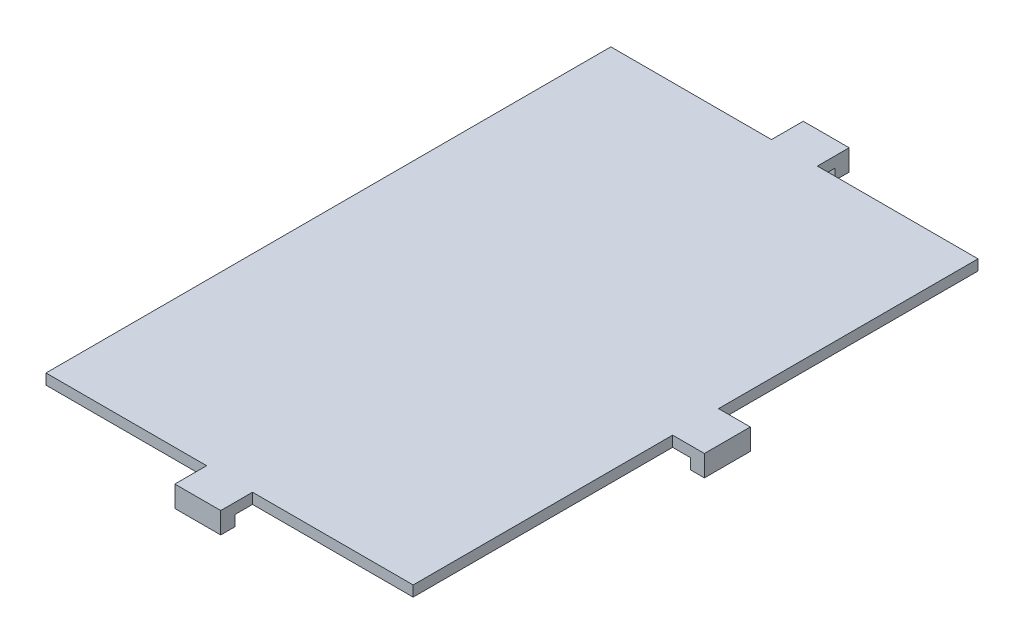
ISO-10303-21;
HEADER;
FILE_DESCRIPTION(('STEP AP214'),'2;1');
FILE_NAME('part.step','',(''),(''),'','','');
FILE_SCHEMA(('AUTOMOTIVE_DESIGN { 1 0 10303 214 1 1 1 1 }'));
ENDSEC;
DATA;
#1=APPLICATION_CONTEXT('core data for automotive mechanical design processes');
#2=APPLICATION_PROTOCOL_DEFINITION('international standard','automotive_design',2000,#1);
#3=PRODUCT_CONTEXT('',#1,'mechanical');
#4=PRODUCT('Part','Part','',(#3));
#5=PRODUCT_RELATED_PRODUCT_CATEGORY('part','',(#4));
#6=PRODUCT_DEFINITION_FORMATION('','',#4);
#7=PRODUCT_DEFINITION_CONTEXT('part definition',#1,'design');
#8=PRODUCT_DEFINITION('design','',#6,#7);
#9=PRODUCT_DEFINITION_SHAPE('','',#8);
#10=(LENGTH_UNIT() NAMED_UNIT(*) SI_UNIT(.MILLI.,.METRE.));
#11=(NAMED_UNIT(*) PLANE_ANGLE_UNIT() SI_UNIT($,.RADIAN.));
#12=(NAMED_UNIT(*) SI_UNIT($,.STERADIAN.) SOLID_ANGLE_UNIT());
#13=UNCERTAINTY_MEASURE_WITH_UNIT(LENGTH_MEASURE(1.E-05),#10,'distance_accuracy_value','');
#14=(GEOMETRIC_REPRESENTATION_CONTEXT(3) GLOBAL_UNCERTAINTY_ASSIGNED_CONTEXT((#13)) GLOBAL_UNIT_ASSIGNED_CONTEXT((#10,
#11,#12)) REPRESENTATION_CONTEXT('',''));
#15=CARTESIAN_POINT('',(0.,0.,0.));
#16=DIRECTION('',(0.,0.,1.));
#17=DIRECTION('',(1.,0.,0.));
#18=AXIS2_PLACEMENT_3D('',#15,#16,#17);
#19=CARTESIAN_POINT('',(0.,1.5,0.));
#20=DIRECTION('',(0.,-1.,0.));
#21=DIRECTION('',(0.,0.,-1.));
#22=AXIS2_PLACEMENT_3D('',#19,#20,#21);
#23=PLANE('',#22);
#24=DIRECTION('',(1.,0.,0.));
#25=VECTOR('',#24,1.);
#26=CARTESIAN_POINT('',(0.,1.5,-80.5));
#27=LINE('',#26,#25);
#28=CARTESIAN_POINT('',(0.5,1.5,-80.5));
#29=VERTEX_POINT('',#28);
#30=CARTESIAN_POINT('',(23.25,1.5,-80.5));
#31=VERTEX_POINT('',#30);
#32=EDGE_CURVE('E203',#29,#31,#27,.T.);
#33=ORIENTED_EDGE('',*,*,#32,.F.);
#34=DIRECTION('',(0.,0.,-1.));
#35=VECTOR('',#34,1.);
#36=CARTESIAN_POINT('',(0.5,1.5,-80.5));
#37=LINE('',#36,#35);
#38=CARTESIAN_POINT('',(0.500000000000011,1.5,-0.5));
#39=VERTEX_POINT('',#38);
#40=EDGE_CURVE('E189',#39,#29,#37,.T.);
#41=ORIENTED_EDGE('',*,*,#40,.F.);
#42=DIRECTION('',(-1.,0.,0.));
#43=VECTOR('',#42,1.);
#44=CARTESIAN_POINT('',(0.,1.5,-0.5));
#45=LINE('',#44,#43);
#46=CARTESIAN_POINT('',(23.25,1.5,-0.5));
#47=VERTEX_POINT('',#46);
#48=EDGE_CURVE('E200',#47,#39,#45,.T.);
#49=ORIENTED_EDGE('',*,*,#48,.F.);
#50=DIRECTION('',(0.,0.,-1.));
#51=VECTOR('',#50,1.);
#52=CARTESIAN_POINT('',(23.25,1.5,-0.5));
#53=LINE('',#52,#51);
#54=CARTESIAN_POINT('',(23.25,1.5,4.));
#55=VERTEX_POINT('',#54);
#56=EDGE_CURVE('E339',#55,#47,#53,.T.);
#57=ORIENTED_EDGE('',*,*,#56,.F.);
#58=DIRECTION('',(1.,0.,0.));
#59=VECTOR('',#58,1.);
#60=CARTESIAN_POINT('',(23.,1.5,4.));
#61=LINE('',#60,#59);
#62=CARTESIAN_POINT('',(29.75,1.5,4.));
#63=VERTEX_POINT('',#62);
#64=EDGE_CURVE('E226',#55,#63,#61,.T.);
#65=ORIENTED_EDGE('',*,*,#64,.T.);
#66=DIRECTION('',(0.,0.,1.));
#67=VECTOR('',#66,1.);
#68=CARTESIAN_POINT('',(29.75,1.5,4.));
#69=LINE('',#68,#67);
#70=CARTESIAN_POINT('',(29.75,1.5,-0.5));
#71=VERTEX_POINT('',#70);
#72=EDGE_CURVE('E322',#71,#63,#69,.T.);
#73=ORIENTED_EDGE('',*,*,#72,.F.);
#74=DIRECTION('',(-1.,0.,0.));
#75=VECTOR('',#74,1.);
#76=CARTESIAN_POINT('',(30.,1.5,-0.5));
#77=LINE('',#76,#75);
#78=CARTESIAN_POINT('',(52.5,1.5,-0.5));
#79=VERTEX_POINT('',#78);
#80=EDGE_CURVE('E214',#79,#71,#77,.T.);
#81=ORIENTED_EDGE('',*,*,#80,.F.);
#82=DIRECTION('',(0.,0.,1.));
#83=VECTOR('',#82,1.);
#84=CARTESIAN_POINT('',(52.5,1.5,-0.5));
#85=LINE('',#84,#83);
#86=CARTESIAN_POINT('',(52.5,1.5,-37.25));
#87=VERTEX_POINT('',#86);
#88=EDGE_CURVE('E321',#87,#79,#85,.T.);
#89=ORIENTED_EDGE('',*,*,#88,.F.);
#90=DIRECTION('',(-1.,0.,0.));
#91=VECTOR('',#90,1.);
#92=CARTESIAN_POINT('',(53.,1.5,-37.25));
#93=LINE('',#92,#91);
#94=CARTESIAN_POINT('',(57.,1.5,-37.25));
#95=VERTEX_POINT('',#94);
#96=EDGE_CURVE('E359',#95,#87,#93,.T.);
#97=ORIENTED_EDGE('',*,*,#96,.F.);
#98=DIRECTION('',(0.,0.,-1.));
#99=VECTOR('',#98,1.);
#100=CARTESIAN_POINT('',(57.,1.5,-44.));
#101=LINE('',#100,#99);
#102=CARTESIAN_POINT('',(57.,1.5,-43.75));
#103=VERTEX_POINT('',#102);
#104=EDGE_CURVE('E248',#95,#103,#101,.T.);
#105=ORIENTED_EDGE('',*,*,#104,.T.);
#106=DIRECTION('',(1.,0.,0.));
#107=VECTOR('',#106,1.);
#108=CARTESIAN_POINT('',(53.,1.5,-43.75));
#109=LINE('',#108,#107);
#110=CARTESIAN_POINT('',(52.5,1.5,-43.75));
#111=VERTEX_POINT('',#110);
#112=EDGE_CURVE('E353',#111,#103,#109,.T.);
#113=ORIENTED_EDGE('',*,*,#112,.F.);
#114=DIRECTION('',(0.,0.,1.));
#115=VECTOR('',#114,1.);
#116=CARTESIAN_POINT('',(52.5,1.5,-43.75));
#117=LINE('',#116,#115);
#118=CARTESIAN_POINT('',(52.5,1.5,-80.5));
#119=VERTEX_POINT('',#118);
#120=EDGE_CURVE('E428',#119,#111,#117,.T.);
#121=ORIENTED_EDGE('',*,*,#120,.F.);
#122=DIRECTION('',(1.,0.,0.));
#123=VECTOR('',#122,1.);
#124=CARTESIAN_POINT('',(30.,1.5,-80.5));
#125=LINE('',#124,#123);
#126=CARTESIAN_POINT('',(29.75,1.5,-80.5));
#127=VERTEX_POINT('',#126);
#128=EDGE_CURVE('E213',#127,#119,#125,.T.);
#129=ORIENTED_EDGE('',*,*,#128,.F.);
#130=DIRECTION('',(0.,0.,1.));
#131=VECTOR('',#130,1.);
#132=CARTESIAN_POINT('',(29.75,1.5,-80.5));
#133=LINE('',#132,#131);
#134=CARTESIAN_POINT('',(29.75,1.5,-85.));
#135=VERTEX_POINT('',#134);
#136=EDGE_CURVE('E341',#135,#127,#133,.T.);
#137=ORIENTED_EDGE('',*,*,#136,.F.);
#138=DIRECTION('',(-1.,0.,0.));
#139=VECTOR('',#138,1.);
#140=CARTESIAN_POINT('',(23.,1.5,-85.));
#141=LINE('',#140,#139);
#142=CARTESIAN_POINT('',(23.25,1.5,-85.));
#143=VERTEX_POINT('',#142);
#144=EDGE_CURVE('E236',#135,#143,#141,.T.);
#145=ORIENTED_EDGE('',*,*,#144,.T.);
#146=DIRECTION('',(0.,0.,-1.));
#147=VECTOR('',#146,1.);
#148=CARTESIAN_POINT('',(23.25,1.5,-80.5));
#149=LINE('',#148,#147);
#150=EDGE_CURVE('E350',#31,#143,#149,.T.);
#151=ORIENTED_EDGE('',*,*,#150,.F.);
#152=EDGE_LOOP('',(#33,#41,#49,#57,#65,#73,#81,#89,#97,#105,#113,#121,#129,#137,#145,#151));
#153=FACE_BOUND('',#152,.T.);
#154=ADVANCED_FACE('F39',(#153),#23,.F.);
#155=CARTESIAN_POINT('',(0.,0.,0.));
#156=DIRECTION('',(0.,-1.,0.));
#157=DIRECTION('',(0.,0.,-1.));
#158=AXIS2_PLACEMENT_3D('',#155,#156,#157);
#159=PLANE('',#158);
#160=DIRECTION('',(0.,0.,1.));
#161=VECTOR('',#160,1.);
#162=CARTESIAN_POINT('',(0.500000000000011,0.,0.));
#163=LINE('',#162,#161);
#164=CARTESIAN_POINT('',(0.5,0.,-80.5));
#165=VERTEX_POINT('',#164);
#166=CARTESIAN_POINT('',(0.500000000000011,0.,-0.5));
#167=VERTEX_POINT('',#166);
#168=EDGE_CURVE('E55',#165,#167,#163,.T.);
#169=ORIENTED_EDGE('',*,*,#168,.F.);
#170=DIRECTION('',(-1.,0.,0.));
#171=VECTOR('',#170,1.);
#172=CARTESIAN_POINT('',(0.,0.,-80.5));
#173=LINE('',#172,#171);
#174=CARTESIAN_POINT('',(23.25,0.,-80.5));
#175=VERTEX_POINT('',#174);
#176=EDGE_CURVE('E278',#175,#165,#173,.T.);
#177=ORIENTED_EDGE('',*,*,#176,.F.);
#178=DIRECTION('',(0.,0.,1.));
#179=VECTOR('',#178,1.);
#180=CARTESIAN_POINT('',(23.25,0.,0.));
#181=LINE('',#180,#179);
#182=CARTESIAN_POINT('',(23.25,0.,-83.));
#183=VERTEX_POINT('',#182);
#184=EDGE_CURVE('E397',#183,#175,#181,.T.);
#185=ORIENTED_EDGE('',*,*,#184,.F.);
#186=DIRECTION('',(-1.,0.,0.));
#187=VECTOR('',#186,1.);
#188=CARTESIAN_POINT('',(23.,0.,-83.));
#189=LINE('',#188,#187);
#190=CARTESIAN_POINT('',(29.75,0.,-83.));
#191=VERTEX_POINT('',#190);
#192=EDGE_CURVE('E271',#191,#183,#189,.T.);
#193=ORIENTED_EDGE('',*,*,#192,.F.);
#194=DIRECTION('',(0.,0.,-1.));
#195=VECTOR('',#194,1.);
#196=CARTESIAN_POINT('',(29.75,0.,0.));
#197=LINE('',#196,#195);
#198=CARTESIAN_POINT('',(29.75,0.,-80.5));
#199=VERTEX_POINT('',#198);
#200=EDGE_CURVE('E404',#199,#191,#197,.T.);
#201=ORIENTED_EDGE('',*,*,#200,.F.);
#202=DIRECTION('',(-1.,0.,0.));
#203=VECTOR('',#202,1.);
#204=CARTESIAN_POINT('',(0.,0.,-80.5));
#205=LINE('',#204,#203);
#206=CARTESIAN_POINT('',(52.5,0.,-80.5));
#207=VERTEX_POINT('',#206);
#208=EDGE_CURVE('E275',#207,#199,#205,.T.);
#209=ORIENTED_EDGE('',*,*,#208,.F.);
#210=DIRECTION('',(0.,0.,-1.));
#211=VECTOR('',#210,1.);
#212=CARTESIAN_POINT('',(52.5,0.,0.));
#213=LINE('',#212,#211);
#214=CARTESIAN_POINT('',(52.5,0.,-43.75));
#215=VERTEX_POINT('',#214);
#216=EDGE_CURVE('E328',#215,#207,#213,.T.);
#217=ORIENTED_EDGE('',*,*,#216,.F.);
#218=DIRECTION('',(-1.,0.,0.));
#219=VECTOR('',#218,1.);
#220=CARTESIAN_POINT('',(0.,0.,-43.75));
#221=LINE('',#220,#219);
#222=CARTESIAN_POINT('',(55.,0.,-43.75));
#223=VERTEX_POINT('',#222);
#224=EDGE_CURVE('E220',#223,#215,#221,.T.);
#225=ORIENTED_EDGE('',*,*,#224,.F.);
#226=DIRECTION('',(0.,0.,-1.));
#227=VECTOR('',#226,1.);
#228=CARTESIAN_POINT('',(55.,0.,-44.));
#229=LINE('',#228,#227);
#230=CARTESIAN_POINT('',(55.,0.,-37.25));
#231=VERTEX_POINT('',#230);
#232=EDGE_CURVE('E267',#231,#223,#229,.T.);
#233=ORIENTED_EDGE('',*,*,#232,.F.);
#234=DIRECTION('',(1.,0.,0.));
#235=VECTOR('',#234,1.);
#236=CARTESIAN_POINT('',(0.,0.,-37.25));
#237=LINE('',#236,#235);
#238=CARTESIAN_POINT('',(52.5,0.,-37.25));
#239=VERTEX_POINT('',#238);
#240=EDGE_CURVE('E410',#239,#231,#237,.T.);
#241=ORIENTED_EDGE('',*,*,#240,.F.);
#242=DIRECTION('',(0.,0.,-1.));
#243=VECTOR('',#242,1.);
#244=CARTESIAN_POINT('',(52.5,0.,0.));
#245=LINE('',#244,#243);
#246=CARTESIAN_POINT('',(52.5,0.,-0.5));
#247=VERTEX_POINT('',#246);
#248=EDGE_CURVE('E334',#247,#239,#245,.T.);
#249=ORIENTED_EDGE('',*,*,#248,.F.);
#250=DIRECTION('',(1.,0.,0.));
#251=VECTOR('',#250,1.);
#252=CARTESIAN_POINT('',(0.,0.,-0.5));
#253=LINE('',#252,#251);
#254=CARTESIAN_POINT('',(29.75,0.,-0.5));
#255=VERTEX_POINT('',#254);
#256=EDGE_CURVE('E282',#255,#247,#253,.T.);
#257=ORIENTED_EDGE('',*,*,#256,.F.);
#258=DIRECTION('',(0.,0.,-1.));
#259=VECTOR('',#258,1.);
#260=CARTESIAN_POINT('',(29.75,0.,0.));
#261=LINE('',#260,#259);
#262=CARTESIAN_POINT('',(29.75,0.,2.));
#263=VERTEX_POINT('',#262);
#264=EDGE_CURVE('E384',#263,#255,#261,.T.);
#265=ORIENTED_EDGE('',*,*,#264,.F.);
#266=DIRECTION('',(1.,0.,0.));
#267=VECTOR('',#266,1.);
#268=CARTESIAN_POINT('',(23.,0.,2.));
#269=LINE('',#268,#267);
#270=CARTESIAN_POINT('',(23.25,0.,2.));
#271=VERTEX_POINT('',#270);
#272=EDGE_CURVE('E260',#271,#263,#269,.T.);
#273=ORIENTED_EDGE('',*,*,#272,.F.);
#274=DIRECTION('',(0.,0.,1.));
#275=VECTOR('',#274,1.);
#276=CARTESIAN_POINT('',(23.25,0.,0.));
#277=LINE('',#276,#275);
#278=CARTESIAN_POINT('',(23.25,0.,-0.5));
#279=VERTEX_POINT('',#278);
#280=EDGE_CURVE('E391',#279,#271,#277,.T.);
#281=ORIENTED_EDGE('',*,*,#280,.F.);
#282=DIRECTION('',(1.,0.,0.));
#283=VECTOR('',#282,1.);
#284=CARTESIAN_POINT('',(0.,0.,-0.5));
#285=LINE('',#284,#283);
#286=EDGE_CURVE('E286',#167,#279,#285,.T.);
#287=ORIENTED_EDGE('',*,*,#286,.F.);
#288=EDGE_LOOP('',(#169,#177,#185,#193,#201,#209,#217,#225,#233,#241,#249,#257,#265,#273,#281,#287));
#289=FACE_BOUND('',#288,.T.);
#290=ADVANCED_FACE('F41',(#289),#159,.T.);
#291=CARTESIAN_POINT('',(55.,-1.5,-44.));
#292=DIRECTION('',(-1.,0.,0.));
#293=DIRECTION('',(0.,0.,1.));
#294=AXIS2_PLACEMENT_3D('',#291,#292,#293);
#295=PLANE('',#294);
#296=DIRECTION('',(0.,1.,0.));
#297=VECTOR('',#296,1.);
#298=CARTESIAN_POINT('',(55.,-1.5,-43.75));
#299=LINE('',#298,#297);
#300=CARTESIAN_POINT('',(55.,-1.5,-43.75));
#301=VERTEX_POINT('',#300);
#302=EDGE_CURVE('E412',#301,#223,#299,.T.);
#303=ORIENTED_EDGE('',*,*,#302,.F.);
#304=DIRECTION('',(0.,0.,1.));
#305=VECTOR('',#304,1.);
#306=CARTESIAN_POINT('',(55.,-1.5,-44.));
#307=LINE('',#306,#305);
#308=CARTESIAN_POINT('',(55.,-1.5,-37.25));
#309=VERTEX_POINT('',#308);
#310=EDGE_CURVE('E252',#301,#309,#307,.T.);
#311=ORIENTED_EDGE('',*,*,#310,.T.);
#312=DIRECTION('',(0.,-1.,0.));
#313=VECTOR('',#312,1.);
#314=CARTESIAN_POINT('',(55.,-1.5,-37.25));
#315=LINE('',#314,#313);
#316=EDGE_CURVE('E407',#231,#309,#315,.T.);
#317=ORIENTED_EDGE('',*,*,#316,.F.);
#318=ORIENTED_EDGE('',*,*,#232,.T.);
#319=EDGE_LOOP('',(#303,#311,#317,#318));
#320=FACE_BOUND('',#319,.T.);
#321=ADVANCED_FACE('F486',(#320),#295,.T.);
#322=CARTESIAN_POINT('',(57.,-1.5,-44.));
#323=DIRECTION('',(1.,0.,0.));
#324=DIRECTION('',(0.,0.,-1.));
#325=AXIS2_PLACEMENT_3D('',#322,#323,#324);
#326=PLANE('',#325);
#327=DIRECTION('',(0.,1.,0.));
#328=VECTOR('',#327,1.);
#329=CARTESIAN_POINT('',(57.,-8.5,-43.75));
#330=LINE('',#329,#328);
#331=CARTESIAN_POINT('',(57.,-1.5,-43.75));
#332=VERTEX_POINT('',#331);
#333=EDGE_CURVE('E63',#332,#103,#330,.T.);
#334=ORIENTED_EDGE('',*,*,#333,.T.);
#335=ORIENTED_EDGE('',*,*,#104,.F.);
#336=DIRECTION('',(0.,1.,0.));
#337=VECTOR('',#336,1.);
#338=CARTESIAN_POINT('',(57.,-8.5,-37.25));
#339=LINE('',#338,#337);
#340=CARTESIAN_POINT('',(57.,-1.5,-37.25));
#341=VERTEX_POINT('',#340);
#342=EDGE_CURVE('E356',#341,#95,#339,.T.);
#343=ORIENTED_EDGE('',*,*,#342,.F.);
#344=DIRECTION('',(0.,0.,-1.));
#345=VECTOR('',#344,1.);
#346=CARTESIAN_POINT('',(57.,-1.5,-44.));
#347=LINE('',#346,#345);
#348=EDGE_CURVE('E256',#341,#332,#347,.T.);
#349=ORIENTED_EDGE('',*,*,#348,.T.);
#350=EDGE_LOOP('',(#334,#335,#343,#349));
#351=FACE_BOUND('',#350,.T.);
#352=ADVANCED_FACE('F480',(#351),#326,.T.);
#353=CARTESIAN_POINT('',(0.,-1.5,0.));
#354=DIRECTION('',(0.,1.,0.));
#355=DIRECTION('',(0.,0.,1.));
#356=AXIS2_PLACEMENT_3D('',#353,#354,#355);
#357=PLANE('',#356);
#358=ORIENTED_EDGE('',*,*,#310,.F.);
#359=DIRECTION('',(1.,0.,0.));
#360=VECTOR('',#359,1.);
#361=CARTESIAN_POINT('',(0.,-1.5,-43.75));
#362=LINE('',#361,#360);
#363=EDGE_CURVE('E195',#301,#332,#362,.T.);
#364=ORIENTED_EDGE('',*,*,#363,.T.);
#365=ORIENTED_EDGE('',*,*,#348,.F.);
#366=DIRECTION('',(-1.,0.,0.));
#367=VECTOR('',#366,1.);
#368=CARTESIAN_POINT('',(0.,-1.5,-37.25));
#369=LINE('',#368,#367);
#370=EDGE_CURVE('E303',#341,#309,#369,.T.);
#371=ORIENTED_EDGE('',*,*,#370,.T.);
#372=EDGE_LOOP('',(#358,#364,#365,#371));
#373=FACE_BOUND('',#372,.T.);
#374=ADVANCED_FACE('F484',(#373),#357,.F.);
#375=CARTESIAN_POINT('',(23.,-1.5,-85.));
#376=DIRECTION('',(0.,0.,-1.));
#377=DIRECTION('',(-1.,0.,0.));
#378=AXIS2_PLACEMENT_3D('',#375,#376,#377);
#379=PLANE('',#378);
#380=DIRECTION('',(0.,1.,0.));
#381=VECTOR('',#380,1.);
#382=CARTESIAN_POINT('',(29.75,-8.5,-85.));
#383=LINE('',#382,#381);
#384=CARTESIAN_POINT('',(29.75,-1.5,-85.));
#385=VERTEX_POINT('',#384);
#386=EDGE_CURVE('E345',#385,#135,#383,.T.);
#387=ORIENTED_EDGE('',*,*,#386,.F.);
#388=DIRECTION('',(-1.,0.,0.));
#389=VECTOR('',#388,1.);
#390=CARTESIAN_POINT('',(23.,-1.5,-85.));
#391=LINE('',#390,#389);
#392=CARTESIAN_POINT('',(23.25,-1.5,-85.));
#393=VERTEX_POINT('',#392);
#394=EDGE_CURVE('E244',#385,#393,#391,.T.);
#395=ORIENTED_EDGE('',*,*,#394,.T.);
#396=DIRECTION('',(0.,1.,0.));
#397=VECTOR('',#396,1.);
#398=CARTESIAN_POINT('',(23.25,-8.5,-85.));
#399=LINE('',#398,#397);
#400=EDGE_CURVE('E374',#393,#143,#399,.T.);
#401=ORIENTED_EDGE('',*,*,#400,.T.);
#402=ORIENTED_EDGE('',*,*,#144,.F.);
#403=EDGE_LOOP('',(#387,#395,#401,#402));
#404=FACE_BOUND('',#403,.T.);
#405=ADVANCED_FACE('F444',(#404),#379,.T.);
#406=CARTESIAN_POINT('',(23.,-1.5,-83.));
#407=DIRECTION('',(0.,0.,1.));
#408=DIRECTION('',(1.,0.,0.));
#409=AXIS2_PLACEMENT_3D('',#406,#407,#408);
#410=PLANE('',#409);
#411=DIRECTION('',(0.,-1.,0.));
#412=VECTOR('',#411,1.);
#413=CARTESIAN_POINT('',(29.75,-1.5,-83.));
#414=LINE('',#413,#412);
#415=CARTESIAN_POINT('',(29.75,-1.5,-83.));
#416=VERTEX_POINT('',#415);
#417=EDGE_CURVE('E401',#191,#416,#414,.T.);
#418=ORIENTED_EDGE('',*,*,#417,.F.);
#419=ORIENTED_EDGE('',*,*,#192,.T.);
#420=DIRECTION('',(0.,1.,0.));
#421=VECTOR('',#420,1.);
#422=CARTESIAN_POINT('',(23.25,-1.5,-83.));
#423=LINE('',#422,#421);
#424=CARTESIAN_POINT('',(23.25,-1.5,-83.));
#425=VERTEX_POINT('',#424);
#426=EDGE_CURVE('E394',#425,#183,#423,.T.);
#427=ORIENTED_EDGE('',*,*,#426,.F.);
#428=DIRECTION('',(1.,0.,0.));
#429=VECTOR('',#428,1.);
#430=CARTESIAN_POINT('',(23.,-1.5,-83.));
#431=LINE('',#430,#429);
#432=EDGE_CURVE('E240',#425,#416,#431,.T.);
#433=ORIENTED_EDGE('',*,*,#432,.T.);
#434=EDGE_LOOP('',(#418,#419,#427,#433));
#435=FACE_BOUND('',#434,.T.);
#436=ADVANCED_FACE('F455',(#435),#410,.T.);
#437=CARTESIAN_POINT('',(0.,-1.5,0.));
#438=DIRECTION('',(0.,-1.,0.));
#439=DIRECTION('',(0.,0.,-1.));
#440=AXIS2_PLACEMENT_3D('',#437,#438,#439);
#441=PLANE('',#440);
#442=DIRECTION('',(0.,0.,-1.));
#443=VECTOR('',#442,1.);
#444=CARTESIAN_POINT('',(29.75,-1.5,0.));
#445=LINE('',#444,#443);
#446=EDGE_CURVE('E300',#416,#385,#445,.T.);
#447=ORIENTED_EDGE('',*,*,#446,.F.);
#448=ORIENTED_EDGE('',*,*,#432,.F.);
#449=DIRECTION('',(0.,0.,1.));
#450=VECTOR('',#449,1.);
#451=CARTESIAN_POINT('',(23.25,-1.5,0.));
#452=LINE('',#451,#450);
#453=EDGE_CURVE('E297',#393,#425,#452,.T.);
#454=ORIENTED_EDGE('',*,*,#453,.F.);
#455=ORIENTED_EDGE('',*,*,#394,.F.);
#456=EDGE_LOOP('',(#447,#448,#454,#455));
#457=FACE_BOUND('',#456,.T.);
#458=ADVANCED_FACE('F453',(#457),#441,.T.);
#459=CARTESIAN_POINT('',(23.,-1.5,2.));
#460=DIRECTION('',(0.,0.,-1.));
#461=DIRECTION('',(-1.,0.,0.));
#462=AXIS2_PLACEMENT_3D('',#459,#460,#461);
#463=PLANE('',#462);
#464=DIRECTION('',(0.,-1.,0.));
#465=VECTOR('',#464,1.);
#466=CARTESIAN_POINT('',(23.25,-1.5,2.));
#467=LINE('',#466,#465);
#468=CARTESIAN_POINT('',(23.25,-1.5,2.));
#469=VERTEX_POINT('',#468);
#470=EDGE_CURVE('E388',#271,#469,#467,.T.);
#471=ORIENTED_EDGE('',*,*,#470,.F.);
#472=ORIENTED_EDGE('',*,*,#272,.T.);
#473=DIRECTION('',(0.,1.,0.));
#474=VECTOR('',#473,1.);
#475=CARTESIAN_POINT('',(29.75,-1.5,2.));
#476=LINE('',#475,#474);
#477=CARTESIAN_POINT('',(29.75,-1.5,2.));
#478=VERTEX_POINT('',#477);
#479=EDGE_CURVE('E378',#478,#263,#476,.T.);
#480=ORIENTED_EDGE('',*,*,#479,.F.);
#481=DIRECTION('',(-1.,0.,0.));
#482=VECTOR('',#481,1.);
#483=CARTESIAN_POINT('',(23.,-1.5,2.));
#484=LINE('',#483,#482);
#485=EDGE_CURVE('E232',#478,#469,#484,.T.);
#486=ORIENTED_EDGE('',*,*,#485,.T.);
#487=EDGE_LOOP('',(#471,#472,#480,#486));
#488=FACE_BOUND('',#487,.T.);
#489=ADVANCED_FACE('F604',(#488),#463,.T.);
#490=CARTESIAN_POINT('',(23.,-1.5,4.));
#491=DIRECTION('',(0.,0.,1.));
#492=DIRECTION('',(1.,0.,0.));
#493=AXIS2_PLACEMENT_3D('',#490,#491,#492);
#494=PLANE('',#493);
#495=DIRECTION('',(0.,1.,0.));
#496=VECTOR('',#495,1.);
#497=CARTESIAN_POINT('',(23.25,-8.5,4.));
#498=LINE('',#497,#496);
#499=CARTESIAN_POINT('',(23.25,-1.5,4.));
#500=VERTEX_POINT('',#499);
#501=EDGE_CURVE('E366',#500,#55,#498,.T.);
#502=ORIENTED_EDGE('',*,*,#501,.F.);
#503=DIRECTION('',(1.,0.,0.));
#504=VECTOR('',#503,1.);
#505=CARTESIAN_POINT('',(23.,-1.5,4.));
#506=LINE('',#505,#504);
#507=CARTESIAN_POINT('',(29.75,-1.5,4.));
#508=VERTEX_POINT('',#507);
#509=EDGE_CURVE('E228',#500,#508,#506,.T.);
#510=ORIENTED_EDGE('',*,*,#509,.T.);
#511=DIRECTION('',(0.,1.,0.));
#512=VECTOR('',#511,1.);
#513=CARTESIAN_POINT('',(29.75,-8.5,4.));
#514=LINE('',#513,#512);
#515=EDGE_CURVE('E332',#508,#63,#514,.T.);
#516=ORIENTED_EDGE('',*,*,#515,.T.);
#517=ORIENTED_EDGE('',*,*,#64,.F.);
#518=EDGE_LOOP('',(#502,#510,#516,#517));
#519=FACE_BOUND('',#518,.T.);
#520=ADVANCED_FACE('F602',(#519),#494,.T.);
#521=CARTESIAN_POINT('',(0.,-1.5,0.));
#522=DIRECTION('',(0.,1.,0.));
#523=DIRECTION('',(0.,0.,1.));
#524=AXIS2_PLACEMENT_3D('',#521,#522,#523);
#525=PLANE('',#524);
#526=ORIENTED_EDGE('',*,*,#509,.F.);
#527=DIRECTION('',(0.,0.,-1.));
#528=VECTOR('',#527,1.);
#529=CARTESIAN_POINT('',(23.25,-1.5,0.));
#530=LINE('',#529,#528);
#531=EDGE_CURVE('E293',#500,#469,#530,.T.);
#532=ORIENTED_EDGE('',*,*,#531,.T.);
#533=ORIENTED_EDGE('',*,*,#485,.F.);
#534=DIRECTION('',(0.,0.,1.));
#535=VECTOR('',#534,1.);
#536=CARTESIAN_POINT('',(29.75,-1.5,0.));
#537=LINE('',#536,#535);
#538=EDGE_CURVE('E289',#478,#508,#537,.T.);
#539=ORIENTED_EDGE('',*,*,#538,.T.);
#540=EDGE_LOOP('',(#526,#532,#533,#539));
#541=FACE_BOUND('',#540,.T.);
#542=ADVANCED_FACE('F513',(#541),#525,.F.);
#543=CARTESIAN_POINT('',(30.,-8.5,-80.5));
#544=DIRECTION('',(0.,0.,1.));
#545=DIRECTION('',(1.,0.,0.));
#546=AXIS2_PLACEMENT_3D('',#543,#544,#545);
#547=PLANE('',#546);
#548=ORIENTED_EDGE('',*,*,#128,.T.);
#549=DIRECTION('',(0.,-1.,0.));
#550=VECTOR('',#549,1.);
#551=CARTESIAN_POINT('',(52.5,-8.5,-80.5));
#552=LINE('',#551,#550);
#553=EDGE_CURVE('E11',#119,#207,#552,.T.);
#554=ORIENTED_EDGE('',*,*,#553,.T.);
#555=ORIENTED_EDGE('',*,*,#208,.T.);
#556=DIRECTION('',(0.,1.,0.));
#557=VECTOR('',#556,1.);
#558=CARTESIAN_POINT('',(29.75,-8.5,-80.5));
#559=LINE('',#558,#557);
#560=EDGE_CURVE('E346',#199,#127,#559,.T.);
#561=ORIENTED_EDGE('',*,*,#560,.T.);
#562=EDGE_LOOP('',(#548,#554,#555,#561));
#563=FACE_BOUND('',#562,.T.);
#564=ADVANCED_FACE('F436',(#563),#547,.F.);
#565=CARTESIAN_POINT('',(0.,-8.5,-80.5));
#566=DIRECTION('',(0.,0.,1.));
#567=DIRECTION('',(1.,0.,0.));
#568=AXIS2_PLACEMENT_3D('',#565,#566,#567);
#569=PLANE('',#568);
#570=ORIENTED_EDGE('',*,*,#176,.T.);
#571=DIRECTION('',(0.,1.,0.));
#572=VECTOR('',#571,1.);
#573=CARTESIAN_POINT('',(0.5,-8.5,-80.5));
#574=LINE('',#573,#572);
#575=EDGE_CURVE('E205',#165,#29,#574,.T.);
#576=ORIENTED_EDGE('',*,*,#575,.T.);
#577=ORIENTED_EDGE('',*,*,#32,.T.);
#578=DIRECTION('',(0.,1.,0.));
#579=VECTOR('',#578,1.);
#580=CARTESIAN_POINT('',(23.25,-8.5,-80.5));
#581=LINE('',#580,#579);
#582=EDGE_CURVE('E373',#175,#31,#581,.T.);
#583=ORIENTED_EDGE('',*,*,#582,.F.);
#584=EDGE_LOOP('',(#570,#576,#577,#583));
#585=FACE_BOUND('',#584,.T.);
#586=ADVANCED_FACE('F459',(#585),#569,.F.);
#587=CARTESIAN_POINT('',(30.,-8.5,-0.5));
#588=DIRECTION('',(0.,0.,-1.));
#589=DIRECTION('',(-1.,0.,0.));
#590=AXIS2_PLACEMENT_3D('',#587,#588,#589);
#591=PLANE('',#590);
#592=ORIENTED_EDGE('',*,*,#256,.T.);
#593=DIRECTION('',(0.,1.,0.));
#594=VECTOR('',#593,1.);
#595=CARTESIAN_POINT('',(52.5,-8.5,-0.5));
#596=LINE('',#595,#594);
#597=EDGE_CURVE('E48',#247,#79,#596,.T.);
#598=ORIENTED_EDGE('',*,*,#597,.T.);
#599=ORIENTED_EDGE('',*,*,#80,.T.);
#600=DIRECTION('',(0.,1.,0.));
#601=VECTOR('',#600,1.);
#602=CARTESIAN_POINT('',(29.75,-8.5,-0.5));
#603=LINE('',#602,#601);
#604=EDGE_CURVE('E327',#255,#71,#603,.T.);
#605=ORIENTED_EDGE('',*,*,#604,.F.);
#606=EDGE_LOOP('',(#592,#598,#599,#605));
#607=FACE_BOUND('',#606,.T.);
#608=ADVANCED_FACE('F312',(#607),#591,.F.);
#609=CARTESIAN_POINT('',(0.,-8.5,-0.5));
#610=DIRECTION('',(0.,0.,-1.));
#611=DIRECTION('',(-1.,0.,0.));
#612=AXIS2_PLACEMENT_3D('',#609,#610,#611);
#613=PLANE('',#612);
#614=ORIENTED_EDGE('',*,*,#48,.T.);
#615=DIRECTION('',(0.,-1.,0.));
#616=VECTOR('',#615,1.);
#617=CARTESIAN_POINT('',(0.500000000000011,-8.5,-0.5));
#618=LINE('',#617,#616);
#619=EDGE_CURVE('E186',#39,#167,#618,.T.);
#620=ORIENTED_EDGE('',*,*,#619,.T.);
#621=ORIENTED_EDGE('',*,*,#286,.T.);
#622=DIRECTION('',(0.,1.,0.));
#623=VECTOR('',#622,1.);
#624=CARTESIAN_POINT('',(23.25,-8.5,-0.5));
#625=LINE('',#624,#623);
#626=EDGE_CURVE('E210',#279,#47,#625,.T.);
#627=ORIENTED_EDGE('',*,*,#626,.T.);
#628=EDGE_LOOP('',(#614,#620,#621,#627));
#629=FACE_BOUND('',#628,.T.);
#630=ADVANCED_FACE('F208',(#629),#613,.F.);
#631=CARTESIAN_POINT('',(23.25,-8.5,-0.5));
#632=DIRECTION('',(1.,0.,0.));
#633=DIRECTION('',(0.,0.,-1.));
#634=AXIS2_PLACEMENT_3D('',#631,#632,#633);
#635=PLANE('',#634);
#636=ORIENTED_EDGE('',*,*,#280,.T.);
#637=ORIENTED_EDGE('',*,*,#470,.T.);
#638=ORIENTED_EDGE('',*,*,#531,.F.);
#639=ORIENTED_EDGE('',*,*,#501,.T.);
#640=ORIENTED_EDGE('',*,*,#56,.T.);
#641=ORIENTED_EDGE('',*,*,#626,.F.);
#642=EDGE_LOOP('',(#636,#637,#638,#639,#640,#641));
#643=FACE_BOUND('',#642,.T.);
#644=ADVANCED_FACE('F543',(#643),#635,.F.);
#645=CARTESIAN_POINT('',(29.75,-8.5,4.));
#646=DIRECTION('',(-1.,0.,0.));
#647=DIRECTION('',(0.,0.,1.));
#648=AXIS2_PLACEMENT_3D('',#645,#646,#647);
#649=PLANE('',#648);
#650=ORIENTED_EDGE('',*,*,#264,.T.);
#651=ORIENTED_EDGE('',*,*,#604,.T.);
#652=ORIENTED_EDGE('',*,*,#72,.T.);
#653=ORIENTED_EDGE('',*,*,#515,.F.);
#654=ORIENTED_EDGE('',*,*,#538,.F.);
#655=ORIENTED_EDGE('',*,*,#479,.T.);
#656=EDGE_LOOP('',(#650,#651,#652,#653,#654,#655));
#657=FACE_BOUND('',#656,.T.);
#658=ADVANCED_FACE('F593',(#657),#649,.F.);
#659=CARTESIAN_POINT('',(23.25,-8.5,-80.5));
#660=DIRECTION('',(1.,0.,0.));
#661=DIRECTION('',(0.,0.,-1.));
#662=AXIS2_PLACEMENT_3D('',#659,#660,#661);
#663=PLANE('',#662);
#664=ORIENTED_EDGE('',*,*,#184,.T.);
#665=ORIENTED_EDGE('',*,*,#582,.T.);
#666=ORIENTED_EDGE('',*,*,#150,.T.);
#667=ORIENTED_EDGE('',*,*,#400,.F.);
#668=ORIENTED_EDGE('',*,*,#453,.T.);
#669=ORIENTED_EDGE('',*,*,#426,.T.);
#670=EDGE_LOOP('',(#664,#665,#666,#667,#668,#669));
#671=FACE_BOUND('',#670,.T.);
#672=ADVANCED_FACE('F448',(#671),#663,.F.);
#673=CARTESIAN_POINT('',(29.75,-8.5,-80.5));
#674=DIRECTION('',(-1.,0.,0.));
#675=DIRECTION('',(0.,0.,1.));
#676=AXIS2_PLACEMENT_3D('',#673,#674,#675);
#677=PLANE('',#676);
#678=ORIENTED_EDGE('',*,*,#200,.T.);
#679=ORIENTED_EDGE('',*,*,#417,.T.);
#680=ORIENTED_EDGE('',*,*,#446,.T.);
#681=ORIENTED_EDGE('',*,*,#386,.T.);
#682=ORIENTED_EDGE('',*,*,#136,.T.);
#683=ORIENTED_EDGE('',*,*,#560,.F.);
#684=EDGE_LOOP('',(#678,#679,#680,#681,#682,#683));
#685=FACE_BOUND('',#684,.T.);
#686=ADVANCED_FACE('F438',(#685),#677,.F.);
#687=CARTESIAN_POINT('',(53.,-8.5,-37.25));
#688=DIRECTION('',(0.,0.,-1.));
#689=DIRECTION('',(-1.,0.,0.));
#690=AXIS2_PLACEMENT_3D('',#687,#688,#689);
#691=PLANE('',#690);
#692=ORIENTED_EDGE('',*,*,#240,.T.);
#693=ORIENTED_EDGE('',*,*,#316,.T.);
#694=ORIENTED_EDGE('',*,*,#370,.F.);
#695=ORIENTED_EDGE('',*,*,#342,.T.);
#696=ORIENTED_EDGE('',*,*,#96,.T.);
#697=DIRECTION('',(0.,1.,0.));
#698=VECTOR('',#697,1.);
#699=CARTESIAN_POINT('',(52.5,-8.5,-37.25));
#700=LINE('',#699,#698);
#701=EDGE_CURVE('E206',#239,#87,#700,.T.);
#702=ORIENTED_EDGE('',*,*,#701,.F.);
#703=EDGE_LOOP('',(#692,#693,#694,#695,#696,#702));
#704=FACE_BOUND('',#703,.T.);
#705=ADVANCED_FACE('F475',(#704),#691,.F.);
#706=CARTESIAN_POINT('',(53.,-8.5,-43.75));
#707=DIRECTION('',(0.,0.,1.));
#708=DIRECTION('',(1.,0.,0.));
#709=AXIS2_PLACEMENT_3D('',#706,#707,#708);
#710=PLANE('',#709);
#711=ORIENTED_EDGE('',*,*,#224,.T.);
#712=DIRECTION('',(0.,1.,0.));
#713=VECTOR('',#712,1.);
#714=CARTESIAN_POINT('',(52.5,-8.5,-43.75));
#715=LINE('',#714,#713);
#716=EDGE_CURVE('E420',#215,#111,#715,.T.);
#717=ORIENTED_EDGE('',*,*,#716,.T.);
#718=ORIENTED_EDGE('',*,*,#112,.T.);
#719=ORIENTED_EDGE('',*,*,#333,.F.);
#720=ORIENTED_EDGE('',*,*,#363,.F.);
#721=ORIENTED_EDGE('',*,*,#302,.T.);
#722=EDGE_LOOP('',(#711,#717,#718,#719,#720,#721));
#723=FACE_BOUND('',#722,.T.);
#724=ADVANCED_FACE('F419',(#723),#710,.F.);
#725=CARTESIAN_POINT('',(52.5,-8.5,-43.75));
#726=DIRECTION('',(-1.,0.,0.));
#727=DIRECTION('',(0.,0.,1.));
#728=AXIS2_PLACEMENT_3D('',#725,#726,#727);
#729=PLANE('',#728);
#730=ORIENTED_EDGE('',*,*,#216,.T.);
#731=ORIENTED_EDGE('',*,*,#553,.F.);
#732=ORIENTED_EDGE('',*,*,#120,.T.);
#733=ORIENTED_EDGE('',*,*,#716,.F.);
#734=EDGE_LOOP('',(#730,#731,#732,#733));
#735=FACE_BOUND('',#734,.T.);
#736=ADVANCED_FACE('F426',(#735),#729,.F.);
#737=CARTESIAN_POINT('',(52.5,-8.5,-0.5));
#738=DIRECTION('',(-1.,0.,0.));
#739=DIRECTION('',(0.,0.,1.));
#740=AXIS2_PLACEMENT_3D('',#737,#738,#739);
#741=PLANE('',#740);
#742=ORIENTED_EDGE('',*,*,#248,.T.);
#743=ORIENTED_EDGE('',*,*,#701,.T.);
#744=ORIENTED_EDGE('',*,*,#88,.T.);
#745=ORIENTED_EDGE('',*,*,#597,.F.);
#746=EDGE_LOOP('',(#742,#743,#744,#745));
#747=FACE_BOUND('',#746,.T.);
#748=ADVANCED_FACE('F473',(#747),#741,.F.);
#749=CARTESIAN_POINT('',(0.5,-8.5,-80.5));
#750=DIRECTION('',(1.,0.,0.));
#751=DIRECTION('',(0.,0.,-1.));
#752=AXIS2_PLACEMENT_3D('',#749,#750,#751);
#753=PLANE('',#752);
#754=ORIENTED_EDGE('',*,*,#168,.T.);
#755=ORIENTED_EDGE('',*,*,#619,.F.);
#756=ORIENTED_EDGE('',*,*,#40,.T.);
#757=ORIENTED_EDGE('',*,*,#575,.F.);
#758=EDGE_LOOP('',(#754,#755,#756,#757));
#759=FACE_BOUND('',#758,.T.);
#760=ADVANCED_FACE('F188',(#759),#753,.F.);
#761=CLOSED_SHELL('',(#154,#290,#321,#352,#374,#405,#436,#458,#489,#520,#542,#564,#586,#608,
#630,#644,#658,#672,#686,#705,#724,#736,#748,#760));
#762=MANIFOLD_SOLID_BREP('B2',#761);
#763=ADVANCED_BREP_SHAPE_REPRESENTATION('',(#18,#762),#14);
#764=SHAPE_DEFINITION_REPRESENTATION(#9,#763);
ENDSEC;
END-ISO-10303-21;
